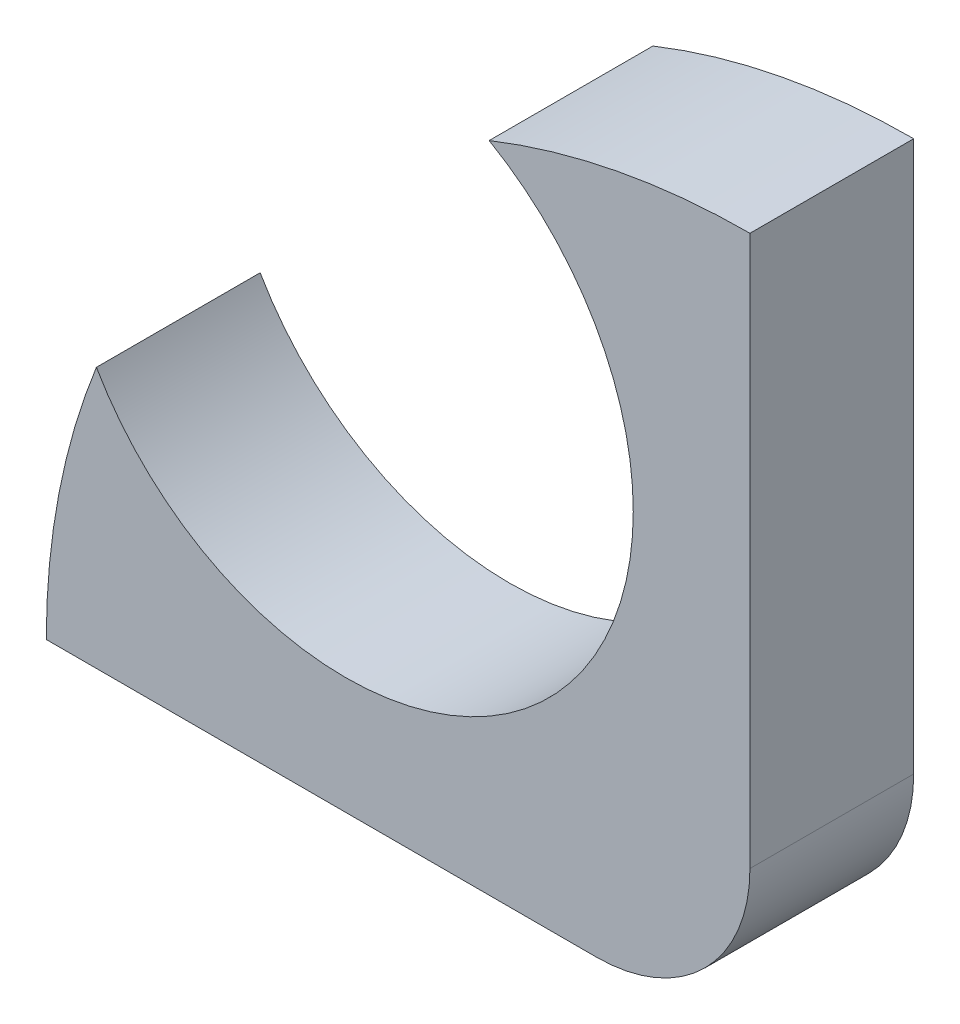
ISO-10303-21;
HEADER;
FILE_DESCRIPTION(('STEP AP214'),'2;1');
FILE_NAME('part.step','',(''),(''),'','','');
FILE_SCHEMA(('AUTOMOTIVE_DESIGN { 1 0 10303 214 1 1 1 1 }'));
ENDSEC;
DATA;
#1=APPLICATION_CONTEXT('core data for automotive mechanical design processes');
#2=APPLICATION_PROTOCOL_DEFINITION('international standard','automotive_design',2000,#1);
#3=PRODUCT_CONTEXT('',#1,'mechanical');
#4=PRODUCT('Part','Part','',(#3));
#5=PRODUCT_RELATED_PRODUCT_CATEGORY('part','',(#4));
#6=PRODUCT_DEFINITION_FORMATION('','',#4);
#7=PRODUCT_DEFINITION_CONTEXT('part definition',#1,'design');
#8=PRODUCT_DEFINITION('design','',#6,#7);
#9=PRODUCT_DEFINITION_SHAPE('','',#8);
#10=(LENGTH_UNIT() NAMED_UNIT(*) SI_UNIT(.MILLI.,.METRE.));
#11=(NAMED_UNIT(*) PLANE_ANGLE_UNIT() SI_UNIT($,.RADIAN.));
#12=(NAMED_UNIT(*) SI_UNIT($,.STERADIAN.) SOLID_ANGLE_UNIT());
#13=UNCERTAINTY_MEASURE_WITH_UNIT(LENGTH_MEASURE(1.E-05),#10,'distance_accuracy_value','');
#14=(GEOMETRIC_REPRESENTATION_CONTEXT(3) GLOBAL_UNCERTAINTY_ASSIGNED_CONTEXT((#13)) GLOBAL_UNIT_ASSIGNED_CONTEXT((#10,
#11,#12)) REPRESENTATION_CONTEXT('',''));
#15=CARTESIAN_POINT('',(0.,0.,0.));
#16=DIRECTION('',(0.,0.,1.));
#17=DIRECTION('',(1.,0.,0.));
#18=AXIS2_PLACEMENT_3D('',#15,#16,#17);
#19=CARTESIAN_POINT('',(18.45,-18.45,1.));
#20=DIRECTION('',(0.,0.,-1.));
#21=DIRECTION('',(0.,-1.,0.));
#22=AXIS2_PLACEMENT_3D('',#19,#20,#21);
#23=PLANE('',#22);
#24=CARTESIAN_POINT('',(18.45,-18.45,1.));
#25=DIRECTION('',(0.,0.,-1.));
#26=DIRECTION('',(-1.,0.,0.));
#27=AXIS2_PLACEMENT_3D('',#24,#25,#26);
#28=CIRCLE('',#27,1.5);
#29=CARTESIAN_POINT('',(19.95,-18.45,1.));
#30=VERTEX_POINT('',#29);
#31=CARTESIAN_POINT('',(18.45,-19.95,1.));
#32=VERTEX_POINT('',#31);
#33=EDGE_CURVE('E387',#30,#32,#28,.T.);
#34=ORIENTED_EDGE('',*,*,#33,.F.);
#35=DIRECTION('',(0.,-1.,0.));
#36=VECTOR('',#35,1.);
#37=CARTESIAN_POINT('',(19.95,-13.075,1.));
#38=LINE('',#37,#36);
#39=CARTESIAN_POINT('',(19.95,-13.075,1.));
#40=VERTEX_POINT('',#39);
#41=EDGE_CURVE('E27',#40,#30,#38,.T.);
#42=ORIENTED_EDGE('',*,*,#41,.F.);
#43=CARTESIAN_POINT('',(19.95,-19.95,1.));
#44=DIRECTION('',(0.,0.,-1.));
#45=DIRECTION('',(-1.,0.,0.));
#46=AXIS2_PLACEMENT_3D('',#43,#44,#45);
#47=CIRCLE('',#46,6.875);
#48=CARTESIAN_POINT('',(17.4018583423997,-13.5646574803851,1.));
#49=VERTEX_POINT('',#48);
#50=EDGE_CURVE('E131',#49,#40,#47,.T.);
#51=ORIENTED_EDGE('',*,*,#50,.F.);
#52=CARTESIAN_POINT('',(16.,-16.,1.));
#53=DIRECTION('',(0.,0.,1.));
#54=DIRECTION('',(-1.,0.,0.));
#55=AXIS2_PLACEMENT_3D('',#52,#53,#54);
#56=CIRCLE('',#55,2.81);
#57=CARTESIAN_POINT('',(18.81,-16.,1.));
#58=VERTEX_POINT('',#57);
#59=EDGE_CURVE('E142',#58,#49,#56,.T.);
#60=ORIENTED_EDGE('',*,*,#59,.F.);
#61=CARTESIAN_POINT('',(16.,-16.,1.));
#62=DIRECTION('',(0.,0.,1.));
#63=DIRECTION('',(-1.,0.,0.));
#64=AXIS2_PLACEMENT_3D('',#61,#62,#63);
#65=CIRCLE('',#64,2.81);
#66=CARTESIAN_POINT('',(13.5646574803851,-17.4018583423997,1.));
#67=VERTEX_POINT('',#66);
#68=EDGE_CURVE('E94',#67,#58,#65,.T.);
#69=ORIENTED_EDGE('',*,*,#68,.F.);
#70=CARTESIAN_POINT('',(19.95,-19.95,1.));
#71=DIRECTION('',(0.,0.,-1.));
#72=DIRECTION('',(-1.,0.,0.));
#73=AXIS2_PLACEMENT_3D('',#70,#71,#72);
#74=CIRCLE('',#73,6.875);
#75=CARTESIAN_POINT('',(13.075,-19.95,1.));
#76=VERTEX_POINT('',#75);
#77=EDGE_CURVE('E109',#76,#67,#74,.T.);
#78=ORIENTED_EDGE('',*,*,#77,.F.);
#79=DIRECTION('',(-1.,0.,0.));
#80=VECTOR('',#79,1.);
#81=CARTESIAN_POINT('',(18.45,-19.95,1.));
#82=LINE('',#81,#80);
#83=EDGE_CURVE('E151',#32,#76,#82,.T.);
#84=ORIENTED_EDGE('',*,*,#83,.F.);
#85=EDGE_LOOP('',(#34,#42,#51,#60,#69,#78,#84));
#86=FACE_BOUND('',#85,.T.);
#87=ADVANCED_FACE('F16',(#86),#23,.F.);
#88=CARTESIAN_POINT('',(18.45,-18.45,-0.6));
#89=DIRECTION('',(0.,0.,-1.));
#90=DIRECTION('',(0.,-1.,0.));
#91=AXIS2_PLACEMENT_3D('',#88,#89,#90);
#92=PLANE('',#91);
#93=CARTESIAN_POINT('',(18.45,-18.45,-0.6));
#94=DIRECTION('',(0.,0.,-1.));
#95=DIRECTION('',(-1.,0.,0.));
#96=AXIS2_PLACEMENT_3D('',#93,#94,#95);
#97=CIRCLE('',#96,1.5);
#98=CARTESIAN_POINT('',(19.95,-18.45,-0.6));
#99=VERTEX_POINT('',#98);
#100=CARTESIAN_POINT('',(18.45,-19.95,-0.6));
#101=VERTEX_POINT('',#100);
#102=EDGE_CURVE('E118',#99,#101,#97,.T.);
#103=ORIENTED_EDGE('',*,*,#102,.T.);
#104=DIRECTION('',(-1.,0.,0.));
#105=VECTOR('',#104,1.);
#106=CARTESIAN_POINT('',(18.45,-19.95,-0.6));
#107=LINE('',#106,#105);
#108=CARTESIAN_POINT('',(13.075,-19.95,-0.6));
#109=VERTEX_POINT('',#108);
#110=EDGE_CURVE('E102',#101,#109,#107,.T.);
#111=ORIENTED_EDGE('',*,*,#110,.T.);
#112=CARTESIAN_POINT('',(19.95,-19.95,-0.6));
#113=DIRECTION('',(0.,0.,-1.));
#114=DIRECTION('',(-1.,0.,0.));
#115=AXIS2_PLACEMENT_3D('',#112,#113,#114);
#116=CIRCLE('',#115,6.875);
#117=CARTESIAN_POINT('',(13.5646574803851,-17.4018583423997,-0.6));
#118=VERTEX_POINT('',#117);
#119=EDGE_CURVE('E95',#109,#118,#116,.T.);
#120=ORIENTED_EDGE('',*,*,#119,.T.);
#121=CARTESIAN_POINT('',(16.,-16.,-0.6));
#122=DIRECTION('',(0.,0.,1.));
#123=DIRECTION('',(-1.,0.,0.));
#124=AXIS2_PLACEMENT_3D('',#121,#122,#123);
#125=CIRCLE('',#124,2.81);
#126=CARTESIAN_POINT('',(18.81,-16.,-0.6));
#127=VERTEX_POINT('',#126);
#128=EDGE_CURVE('E82',#118,#127,#125,.T.);
#129=ORIENTED_EDGE('',*,*,#128,.T.);
#130=CARTESIAN_POINT('',(16.,-16.,-0.6));
#131=DIRECTION('',(0.,0.,1.));
#132=DIRECTION('',(-1.,0.,0.));
#133=AXIS2_PLACEMENT_3D('',#130,#131,#132);
#134=CIRCLE('',#133,2.81);
#135=CARTESIAN_POINT('',(17.4018583423997,-13.5646574803851,-0.6));
#136=VERTEX_POINT('',#135);
#137=EDGE_CURVE('E152',#127,#136,#134,.T.);
#138=ORIENTED_EDGE('',*,*,#137,.T.);
#139=CARTESIAN_POINT('',(19.95,-19.95,-0.6));
#140=DIRECTION('',(0.,0.,-1.));
#141=DIRECTION('',(-1.,0.,0.));
#142=AXIS2_PLACEMENT_3D('',#139,#140,#141);
#143=CIRCLE('',#142,6.875);
#144=CARTESIAN_POINT('',(19.95,-13.075,-0.6));
#145=VERTEX_POINT('',#144);
#146=EDGE_CURVE('E120',#136,#145,#143,.T.);
#147=ORIENTED_EDGE('',*,*,#146,.T.);
#148=DIRECTION('',(0.,-1.,0.));
#149=VECTOR('',#148,1.);
#150=CARTESIAN_POINT('',(19.95,-13.075,-0.6));
#151=LINE('',#150,#149);
#152=EDGE_CURVE('E11',#145,#99,#151,.T.);
#153=ORIENTED_EDGE('',*,*,#152,.T.);
#154=EDGE_LOOP('',(#103,#111,#120,#129,#138,#147,#153));
#155=FACE_BOUND('',#154,.T.);
#156=ADVANCED_FACE('F100',(#155),#92,.T.);
#157=CARTESIAN_POINT('',(19.95,-13.075,-0.6));
#158=DIRECTION('',(-1.,0.,0.));
#159=DIRECTION('',(0.,0.,1.));
#160=AXIS2_PLACEMENT_3D('',#157,#158,#159);
#161=PLANE('',#160);
#162=ORIENTED_EDGE('',*,*,#41,.T.);
#163=DIRECTION('',(0.,0.,1.));
#164=VECTOR('',#163,1.);
#165=CARTESIAN_POINT('',(19.95,-18.45,-0.6));
#166=LINE('',#165,#164);
#167=EDGE_CURVE('E147',#99,#30,#166,.T.);
#168=ORIENTED_EDGE('',*,*,#167,.F.);
#169=ORIENTED_EDGE('',*,*,#152,.F.);
#170=DIRECTION('',(0.,0.,1.));
#171=VECTOR('',#170,1.);
#172=CARTESIAN_POINT('',(19.95,-13.075,-0.6));
#173=LINE('',#172,#171);
#174=EDGE_CURVE('E122',#145,#40,#173,.T.);
#175=ORIENTED_EDGE('',*,*,#174,.T.);
#176=EDGE_LOOP('',(#162,#168,#169,#175));
#177=FACE_BOUND('',#176,.T.);
#178=ADVANCED_FACE('F208',(#177),#161,.F.);
#179=CARTESIAN_POINT('',(19.95,-19.95,-0.6));
#180=DIRECTION('',(0.,0.,1.));
#181=DIRECTION('',(1.,0.,0.));
#182=AXIS2_PLACEMENT_3D('',#179,#180,#181);
#183=CYLINDRICAL_SURFACE('',#182,6.875);
#184=ORIENTED_EDGE('',*,*,#50,.T.);
#185=ORIENTED_EDGE('',*,*,#174,.F.);
#186=ORIENTED_EDGE('',*,*,#146,.F.);
#187=DIRECTION('',(0.,0.,1.));
#188=VECTOR('',#187,1.);
#189=CARTESIAN_POINT('',(17.4018583423997,-13.5646574803851,-0.6));
#190=LINE('',#189,#188);
#191=EDGE_CURVE('E146',#136,#49,#190,.T.);
#192=ORIENTED_EDGE('',*,*,#191,.T.);
#193=EDGE_LOOP('',(#184,#185,#186,#192));
#194=FACE_BOUND('',#193,.T.);
#195=ADVANCED_FACE('F213',(#194),#183,.T.);
#196=CARTESIAN_POINT('',(16.,-16.,-0.6));
#197=DIRECTION('',(0.,0.,1.));
#198=DIRECTION('',(1.,0.,0.));
#199=AXIS2_PLACEMENT_3D('',#196,#197,#198);
#200=CYLINDRICAL_SURFACE('',#199,2.81);
#201=DIRECTION('',(0.,0.,1.));
#202=VECTOR('',#201,1.);
#203=CARTESIAN_POINT('',(18.81,-16.,-0.6));
#204=LINE('',#203,#202);
#205=EDGE_CURVE('E20',#127,#58,#204,.T.);
#206=ORIENTED_EDGE('',*,*,#205,.F.);
#207=ORIENTED_EDGE('',*,*,#128,.F.);
#208=DIRECTION('',(0.,0.,1.));
#209=VECTOR('',#208,1.);
#210=CARTESIAN_POINT('',(13.5646574803851,-17.4018583423997,-0.6));
#211=LINE('',#210,#209);
#212=EDGE_CURVE('E87',#118,#67,#211,.T.);
#213=ORIENTED_EDGE('',*,*,#212,.T.);
#214=ORIENTED_EDGE('',*,*,#68,.T.);
#215=EDGE_LOOP('',(#206,#207,#213,#214));
#216=FACE_BOUND('',#215,.T.);
#217=ADVANCED_FACE('F84',(#216),#200,.F.);
#218=CARTESIAN_POINT('',(19.95,-19.95,-0.6));
#219=DIRECTION('',(0.,0.,1.));
#220=DIRECTION('',(1.,0.,0.));
#221=AXIS2_PLACEMENT_3D('',#218,#219,#220);
#222=CYLINDRICAL_SURFACE('',#221,6.875);
#223=ORIENTED_EDGE('',*,*,#77,.T.);
#224=ORIENTED_EDGE('',*,*,#212,.F.);
#225=ORIENTED_EDGE('',*,*,#119,.F.);
#226=DIRECTION('',(0.,0.,1.));
#227=VECTOR('',#226,1.);
#228=CARTESIAN_POINT('',(13.075,-19.95,-0.6));
#229=LINE('',#228,#227);
#230=EDGE_CURVE('E139',#109,#76,#229,.T.);
#231=ORIENTED_EDGE('',*,*,#230,.T.);
#232=EDGE_LOOP('',(#223,#224,#225,#231));
#233=FACE_BOUND('',#232,.T.);
#234=ADVANCED_FACE('F108',(#233),#222,.T.);
#235=CARTESIAN_POINT('',(18.45,-19.95,-0.6));
#236=DIRECTION('',(0.,1.,0.));
#237=DIRECTION('',(1.,0.,0.));
#238=AXIS2_PLACEMENT_3D('',#235,#236,#237);
#239=PLANE('',#238);
#240=ORIENTED_EDGE('',*,*,#83,.T.);
#241=ORIENTED_EDGE('',*,*,#230,.F.);
#242=ORIENTED_EDGE('',*,*,#110,.F.);
#243=DIRECTION('',(0.,0.,1.));
#244=VECTOR('',#243,1.);
#245=CARTESIAN_POINT('',(18.45,-19.95,-0.6));
#246=LINE('',#245,#244);
#247=EDGE_CURVE('E194',#101,#32,#246,.T.);
#248=ORIENTED_EDGE('',*,*,#247,.T.);
#249=EDGE_LOOP('',(#240,#241,#242,#248));
#250=FACE_BOUND('',#249,.T.);
#251=ADVANCED_FACE('F18',(#250),#239,.F.);
#252=CARTESIAN_POINT('',(18.45,-18.45,-0.6));
#253=DIRECTION('',(0.,0.,1.));
#254=DIRECTION('',(1.,0.,0.));
#255=AXIS2_PLACEMENT_3D('',#252,#253,#254);
#256=CYLINDRICAL_SURFACE('',#255,1.5);
#257=ORIENTED_EDGE('',*,*,#33,.T.);
#258=ORIENTED_EDGE('',*,*,#247,.F.);
#259=ORIENTED_EDGE('',*,*,#102,.F.);
#260=ORIENTED_EDGE('',*,*,#167,.T.);
#261=EDGE_LOOP('',(#257,#258,#259,#260));
#262=FACE_BOUND('',#261,.T.);
#263=ADVANCED_FACE('F235',(#262),#256,.T.);
#264=CARTESIAN_POINT('',(16.,-16.,-0.6));
#265=DIRECTION('',(0.,0.,1.));
#266=DIRECTION('',(1.,0.,0.));
#267=AXIS2_PLACEMENT_3D('',#264,#265,#266);
#268=CYLINDRICAL_SURFACE('',#267,2.81);
#269=ORIENTED_EDGE('',*,*,#137,.F.);
#270=ORIENTED_EDGE('',*,*,#205,.T.);
#271=ORIENTED_EDGE('',*,*,#59,.T.);
#272=ORIENTED_EDGE('',*,*,#191,.F.);
#273=EDGE_LOOP('',(#269,#270,#271,#272));
#274=FACE_BOUND('',#273,.T.);
#275=ADVANCED_FACE('F165',(#274),#268,.F.);
#276=CLOSED_SHELL('',(#87,#156,#178,#195,#217,#234,#251,#263,#275));
#277=MANIFOLD_SOLID_BREP('B1',#276);
#278=ADVANCED_BREP_SHAPE_REPRESENTATION('',(#18,#277),#14);
#279=SHAPE_DEFINITION_REPRESENTATION(#9,#278);
ENDSEC;
END-ISO-10303-21;
